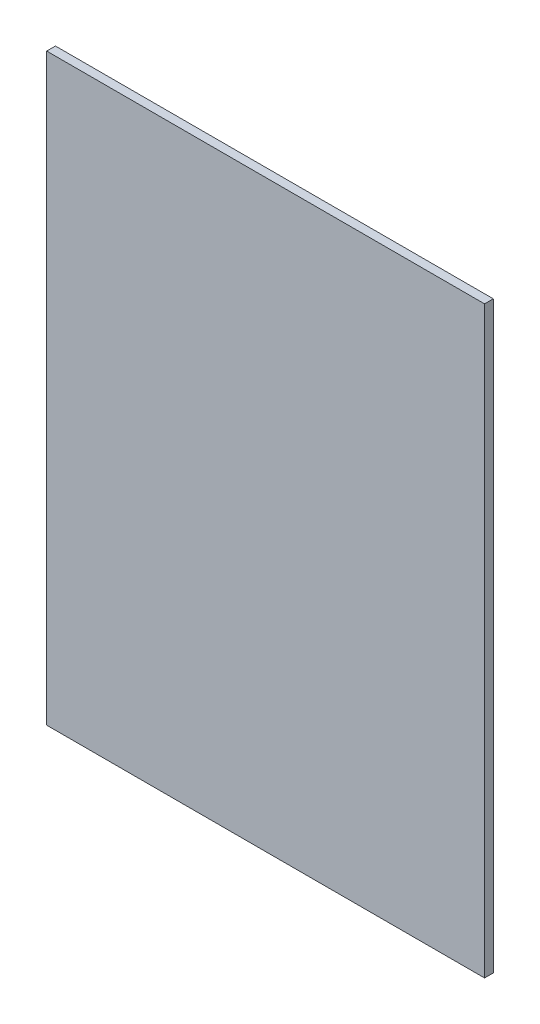
ISO-10303-21;
HEADER;
FILE_DESCRIPTION(('STEP AP214'),'2;1');
FILE_NAME('part.step','',(''),(''),'','','');
FILE_SCHEMA(('AUTOMOTIVE_DESIGN { 1 0 10303 214 1 1 1 1 }'));
ENDSEC;
DATA;
#1=APPLICATION_CONTEXT('core data for automotive mechanical design processes');
#2=APPLICATION_PROTOCOL_DEFINITION('international standard','automotive_design',2000,#1);
#3=PRODUCT_CONTEXT('',#1,'mechanical');
#4=PRODUCT('Part','Part','',(#3));
#5=PRODUCT_RELATED_PRODUCT_CATEGORY('part','',(#4));
#6=PRODUCT_DEFINITION_FORMATION('','',#4);
#7=PRODUCT_DEFINITION_CONTEXT('part definition',#1,'design');
#8=PRODUCT_DEFINITION('design','',#6,#7);
#9=PRODUCT_DEFINITION_SHAPE('','',#8);
#10=(LENGTH_UNIT() NAMED_UNIT(*) SI_UNIT(.MILLI.,.METRE.));
#11=(NAMED_UNIT(*) PLANE_ANGLE_UNIT() SI_UNIT($,.RADIAN.));
#12=(NAMED_UNIT(*) SI_UNIT($,.STERADIAN.) SOLID_ANGLE_UNIT());
#13=UNCERTAINTY_MEASURE_WITH_UNIT(LENGTH_MEASURE(1.E-05),#10,'distance_accuracy_value','');
#14=(GEOMETRIC_REPRESENTATION_CONTEXT(3) GLOBAL_UNCERTAINTY_ASSIGNED_CONTEXT((#13)) GLOBAL_UNIT_ASSIGNED_CONTEXT((#10,
#11,#12)) REPRESENTATION_CONTEXT('',''));
#15=CARTESIAN_POINT('',(0.,0.,0.));
#16=DIRECTION('',(0.,0.,1.));
#17=DIRECTION('',(1.,0.,0.));
#18=AXIS2_PLACEMENT_3D('',#15,#16,#17);
#19=CARTESIAN_POINT('',(75.,100.,3.));
#20=DIRECTION('',(-1.,0.,0.));
#21=DIRECTION('',(0.,-1.,0.));
#22=AXIS2_PLACEMENT_3D('',#19,#20,#21);
#23=PLANE('',#22);
#24=DIRECTION('',(0.,1.,0.));
#25=VECTOR('',#24,1.);
#26=CARTESIAN_POINT('',(75.,100.,0.));
#27=LINE('',#26,#25);
#28=CARTESIAN_POINT('',(75.,-100.,0.));
#29=VERTEX_POINT('',#28);
#30=CARTESIAN_POINT('',(75.,100.,0.));
#31=VERTEX_POINT('',#30);
#32=EDGE_CURVE('E107',#29,#31,#27,.T.);
#33=ORIENTED_EDGE('',*,*,#32,.T.);
#34=DIRECTION('',(0.,0.,-1.));
#35=VECTOR('',#34,1.);
#36=CARTESIAN_POINT('',(75.,100.,3.));
#37=LINE('',#36,#35);
#38=CARTESIAN_POINT('',(75.,100.,3.));
#39=VERTEX_POINT('',#38);
#40=EDGE_CURVE('E11',#39,#31,#37,.T.);
#41=ORIENTED_EDGE('',*,*,#40,.F.);
#42=DIRECTION('',(0.,1.,0.));
#43=VECTOR('',#42,1.);
#44=CARTESIAN_POINT('',(75.,100.,3.));
#45=LINE('',#44,#43);
#46=CARTESIAN_POINT('',(75.,-100.,3.));
#47=VERTEX_POINT('',#46);
#48=EDGE_CURVE('E91',#47,#39,#45,.T.);
#49=ORIENTED_EDGE('',*,*,#48,.F.);
#50=DIRECTION('',(0.,0.,-1.));
#51=VECTOR('',#50,1.);
#52=CARTESIAN_POINT('',(75.,-100.,3.));
#53=LINE('',#52,#51);
#54=EDGE_CURVE('E103',#47,#29,#53,.T.);
#55=ORIENTED_EDGE('',*,*,#54,.T.);
#56=EDGE_LOOP('',(#33,#41,#49,#55));
#57=FACE_BOUND('',#56,.T.);
#58=ADVANCED_FACE('F39',(#57),#23,.F.);
#59=CARTESIAN_POINT('',(-75.,100.,3.));
#60=DIRECTION('',(0.,-1.,0.));
#61=DIRECTION('',(0.,0.,-1.));
#62=AXIS2_PLACEMENT_3D('',#59,#60,#61);
#63=PLANE('',#62);
#64=DIRECTION('',(-1.,0.,0.));
#65=VECTOR('',#64,1.);
#66=CARTESIAN_POINT('',(-75.,100.,0.));
#67=LINE('',#66,#65);
#68=CARTESIAN_POINT('',(-75.,100.,0.));
#69=VERTEX_POINT('',#68);
#70=EDGE_CURVE('E96',#31,#69,#67,.T.);
#71=ORIENTED_EDGE('',*,*,#70,.T.);
#72=DIRECTION('',(0.,0.,-1.));
#73=VECTOR('',#72,1.);
#74=CARTESIAN_POINT('',(-75.,100.,3.));
#75=LINE('',#74,#73);
#76=CARTESIAN_POINT('',(-75.,100.,3.));
#77=VERTEX_POINT('',#76);
#78=EDGE_CURVE('E48',#77,#69,#75,.T.);
#79=ORIENTED_EDGE('',*,*,#78,.F.);
#80=DIRECTION('',(-1.,0.,0.));
#81=VECTOR('',#80,1.);
#82=CARTESIAN_POINT('',(-75.,100.,3.));
#83=LINE('',#82,#81);
#84=EDGE_CURVE('E86',#39,#77,#83,.T.);
#85=ORIENTED_EDGE('',*,*,#84,.F.);
#86=ORIENTED_EDGE('',*,*,#40,.T.);
#87=EDGE_LOOP('',(#71,#79,#85,#86));
#88=FACE_BOUND('',#87,.T.);
#89=ADVANCED_FACE('F95',(#88),#63,.F.);
#90=CARTESIAN_POINT('',(-75.,100.,3.));
#91=DIRECTION('',(1.,0.,0.));
#92=DIRECTION('',(0.,1.,0.));
#93=AXIS2_PLACEMENT_3D('',#90,#91,#92);
#94=PLANE('',#93);
#95=DIRECTION('',(0.,-1.,0.));
#96=VECTOR('',#95,1.);
#97=CARTESIAN_POINT('',(-75.,100.,0.));
#98=LINE('',#97,#96);
#99=CARTESIAN_POINT('',(-75.,-100.,0.));
#100=VERTEX_POINT('',#99);
#101=EDGE_CURVE('E73',#69,#100,#98,.T.);
#102=ORIENTED_EDGE('',*,*,#101,.T.);
#103=DIRECTION('',(0.,0.,-1.));
#104=VECTOR('',#103,1.);
#105=CARTESIAN_POINT('',(-75.,-100.,3.));
#106=LINE('',#105,#104);
#107=CARTESIAN_POINT('',(-75.,-100.,3.));
#108=VERTEX_POINT('',#107);
#109=EDGE_CURVE('E98',#108,#100,#106,.T.);
#110=ORIENTED_EDGE('',*,*,#109,.F.);
#111=DIRECTION('',(0.,-1.,0.));
#112=VECTOR('',#111,1.);
#113=CARTESIAN_POINT('',(-75.,100.,3.));
#114=LINE('',#113,#112);
#115=EDGE_CURVE('E89',#77,#108,#114,.T.);
#116=ORIENTED_EDGE('',*,*,#115,.F.);
#117=ORIENTED_EDGE('',*,*,#78,.T.);
#118=EDGE_LOOP('',(#102,#110,#116,#117));
#119=FACE_BOUND('',#118,.T.);
#120=ADVANCED_FACE('F99',(#119),#94,.F.);
#121=CARTESIAN_POINT('',(-75.,-100.,3.));
#122=DIRECTION('',(0.,1.,0.));
#123=DIRECTION('',(0.,0.,1.));
#124=AXIS2_PLACEMENT_3D('',#121,#122,#123);
#125=PLANE('',#124);
#126=DIRECTION('',(1.,0.,0.));
#127=VECTOR('',#126,1.);
#128=CARTESIAN_POINT('',(-75.,-100.,0.));
#129=LINE('',#128,#127);
#130=EDGE_CURVE('E79',#100,#29,#129,.T.);
#131=ORIENTED_EDGE('',*,*,#130,.T.);
#132=ORIENTED_EDGE('',*,*,#54,.F.);
#133=DIRECTION('',(1.,0.,0.));
#134=VECTOR('',#133,1.);
#135=CARTESIAN_POINT('',(-75.,-100.,3.));
#136=LINE('',#135,#134);
#137=EDGE_CURVE('E56',#108,#47,#136,.T.);
#138=ORIENTED_EDGE('',*,*,#137,.F.);
#139=ORIENTED_EDGE('',*,*,#109,.T.);
#140=EDGE_LOOP('',(#131,#132,#138,#139));
#141=FACE_BOUND('',#140,.T.);
#142=ADVANCED_FACE('F120',(#141),#125,.F.);
#143=CARTESIAN_POINT('',(0.,0.,3.));
#144=DIRECTION('',(0.,0.,1.));
#145=DIRECTION('',(1.,0.,0.));
#146=AXIS2_PLACEMENT_3D('',#143,#144,#145);
#147=PLANE('',#146);
#148=ORIENTED_EDGE('',*,*,#48,.T.);
#149=ORIENTED_EDGE('',*,*,#84,.T.);
#150=ORIENTED_EDGE('',*,*,#115,.T.);
#151=ORIENTED_EDGE('',*,*,#137,.T.);
#152=EDGE_LOOP('',(#148,#149,#150,#151));
#153=FACE_BOUND('',#152,.T.);
#154=ADVANCED_FACE('F87',(#153),#147,.T.);
#155=CARTESIAN_POINT('',(0.,0.,0.));
#156=DIRECTION('',(0.,0.,1.));
#157=DIRECTION('',(1.,0.,0.));
#158=AXIS2_PLACEMENT_3D('',#155,#156,#157);
#159=PLANE('',#158);
#160=ORIENTED_EDGE('',*,*,#32,.F.);
#161=ORIENTED_EDGE('',*,*,#130,.F.);
#162=ORIENTED_EDGE('',*,*,#101,.F.);
#163=ORIENTED_EDGE('',*,*,#70,.F.);
#164=EDGE_LOOP('',(#160,#161,#162,#163));
#165=FACE_BOUND('',#164,.T.);
#166=ADVANCED_FACE('F123',(#165),#159,.F.);
#167=CLOSED_SHELL('',(#58,#89,#120,#142,#154,#166));
#168=MANIFOLD_SOLID_BREP('B2',#167);
#169=ADVANCED_BREP_SHAPE_REPRESENTATION('',(#18,#168),#14);
#170=SHAPE_DEFINITION_REPRESENTATION(#9,#169);
ENDSEC;
END-ISO-10303-21;
